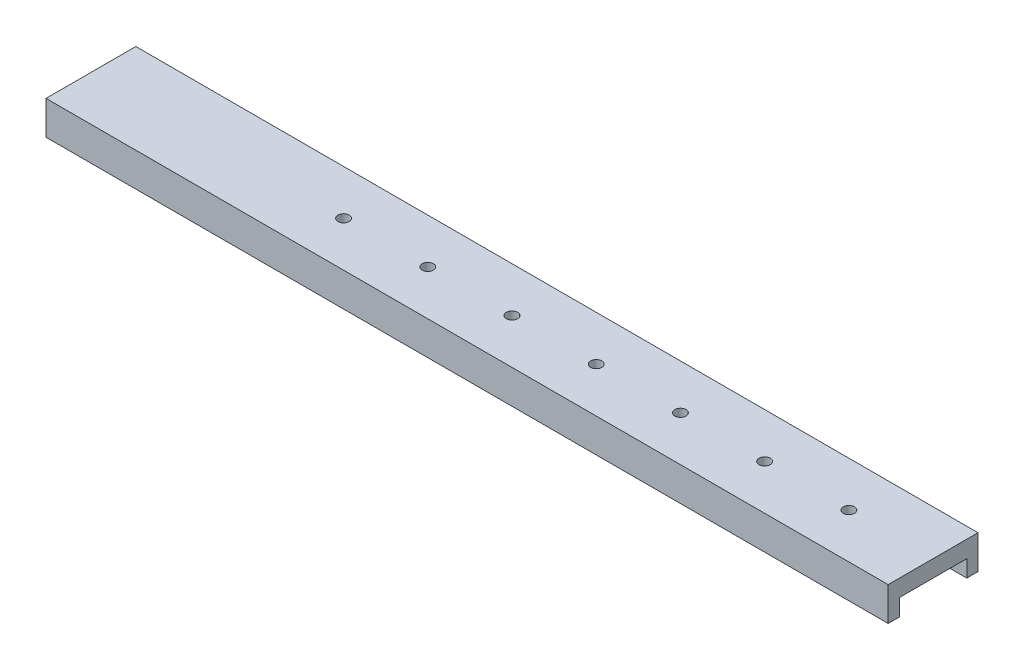
ISO-10303-21;
HEADER;
FILE_DESCRIPTION(('STEP AP214'),'2;1');
FILE_NAME('part.step','',(''),(''),'','','');
FILE_SCHEMA(('AUTOMOTIVE_DESIGN { 1 0 10303 214 1 1 1 1 }'));
ENDSEC;
DATA;
#1=APPLICATION_CONTEXT('core data for automotive mechanical design processes');
#2=APPLICATION_PROTOCOL_DEFINITION('international standard','automotive_design',2000,#1);
#3=PRODUCT_CONTEXT('',#1,'mechanical');
#4=PRODUCT('Part','Part','',(#3));
#5=PRODUCT_RELATED_PRODUCT_CATEGORY('part','',(#4));
#6=PRODUCT_DEFINITION_FORMATION('','',#4);
#7=PRODUCT_DEFINITION_CONTEXT('part definition',#1,'design');
#8=PRODUCT_DEFINITION('design','',#6,#7);
#9=PRODUCT_DEFINITION_SHAPE('','',#8);
#10=(LENGTH_UNIT() NAMED_UNIT(*) SI_UNIT(.MILLI.,.METRE.));
#11=(NAMED_UNIT(*) PLANE_ANGLE_UNIT() SI_UNIT($,.RADIAN.));
#12=(NAMED_UNIT(*) SI_UNIT($,.STERADIAN.) SOLID_ANGLE_UNIT());
#13=UNCERTAINTY_MEASURE_WITH_UNIT(LENGTH_MEASURE(1.E-05),#10,'distance_accuracy_value','');
#14=(GEOMETRIC_REPRESENTATION_CONTEXT(3) GLOBAL_UNCERTAINTY_ASSIGNED_CONTEXT((#13)) GLOBAL_UNIT_ASSIGNED_CONTEXT((#10,
#11,#12)) REPRESENTATION_CONTEXT('',''));
#15=CARTESIAN_POINT('',(0.,0.,0.));
#16=DIRECTION('',(0.,0.,1.));
#17=DIRECTION('',(1.,0.,0.));
#18=AXIS2_PLACEMENT_3D('',#15,#16,#17);
#19=CARTESIAN_POINT('',(375.,-30.,40.));
#20=DIRECTION('',(1.,0.,0.));
#21=DIRECTION('',(0.,0.,-1.));
#22=AXIS2_PLACEMENT_3D('',#19,#20,#21);
#23=PLANE('',#22);
#24=DIRECTION('',(0.,1.,0.));
#25=VECTOR('',#24,1.);
#26=CARTESIAN_POINT('',(375.,-30.,-30.));
#27=LINE('',#26,#25);
#28=CARTESIAN_POINT('',(375.,-30.,-30.));
#29=VERTEX_POINT('',#28);
#30=CARTESIAN_POINT('',(375.,-15.,-30.));
#31=VERTEX_POINT('',#30);
#32=EDGE_CURVE('E125',#29,#31,#27,.T.);
#33=ORIENTED_EDGE('',*,*,#32,.F.);
#34=DIRECTION('',(0.,0.,-1.));
#35=VECTOR('',#34,1.);
#36=CARTESIAN_POINT('',(375.,-30.,40.));
#37=LINE('',#36,#35);
#38=CARTESIAN_POINT('',(375.,-30.,-40.));
#39=VERTEX_POINT('',#38);
#40=EDGE_CURVE('E81',#29,#39,#37,.T.);
#41=ORIENTED_EDGE('',*,*,#40,.T.);
#42=DIRECTION('',(0.,1.,0.));
#43=VECTOR('',#42,1.);
#44=CARTESIAN_POINT('',(375.,-30.,-40.));
#45=LINE('',#44,#43);
#46=CARTESIAN_POINT('',(375.,0.,-40.));
#47=VERTEX_POINT('',#46);
#48=EDGE_CURVE('E190',#39,#47,#45,.T.);
#49=ORIENTED_EDGE('',*,*,#48,.T.);
#50=DIRECTION('',(0.,0.,-1.));
#51=VECTOR('',#50,1.);
#52=CARTESIAN_POINT('',(375.,0.,40.));
#53=LINE('',#52,#51);
#54=CARTESIAN_POINT('',(375.,0.,40.));
#55=VERTEX_POINT('',#54);
#56=EDGE_CURVE('E179',#55,#47,#53,.T.);
#57=ORIENTED_EDGE('',*,*,#56,.F.);
#58=DIRECTION('',(0.,1.,0.));
#59=VECTOR('',#58,1.);
#60=CARTESIAN_POINT('',(375.,-30.,40.));
#61=LINE('',#60,#59);
#62=CARTESIAN_POINT('',(375.,-30.,40.));
#63=VERTEX_POINT('',#62);
#64=EDGE_CURVE('E11',#63,#55,#61,.T.);
#65=ORIENTED_EDGE('',*,*,#64,.F.);
#66=CARTESIAN_POINT('',(375.,-30.,30.));
#67=VERTEX_POINT('',#66);
#68=EDGE_CURVE('E180',#63,#67,#37,.T.);
#69=ORIENTED_EDGE('',*,*,#68,.T.);
#70=DIRECTION('',(0.,-1.,0.));
#71=VECTOR('',#70,1.);
#72=CARTESIAN_POINT('',(375.,-15.,30.));
#73=LINE('',#72,#71);
#74=CARTESIAN_POINT('',(375.,-15.,30.));
#75=VERTEX_POINT('',#74);
#76=EDGE_CURVE('E128',#75,#67,#73,.T.);
#77=ORIENTED_EDGE('',*,*,#76,.F.);
#78=DIRECTION('',(0.,0.,1.));
#79=VECTOR('',#78,1.);
#80=CARTESIAN_POINT('',(375.,-15.,-30.));
#81=LINE('',#80,#79);
#82=EDGE_CURVE('E112',#31,#75,#81,.T.);
#83=ORIENTED_EDGE('',*,*,#82,.F.);
#84=EDGE_LOOP('',(#33,#41,#49,#57,#65,#69,#77,#83));
#85=FACE_BOUND('',#84,.T.);
#86=ADVANCED_FACE('F33',(#85),#23,.T.);
#87=CARTESIAN_POINT('',(-375.,-30.,40.));
#88=DIRECTION('',(0.,0.,1.));
#89=DIRECTION('',(1.,0.,0.));
#90=AXIS2_PLACEMENT_3D('',#87,#88,#89);
#91=PLANE('',#90);
#92=DIRECTION('',(1.,0.,0.));
#93=VECTOR('',#92,1.);
#94=CARTESIAN_POINT('',(-375.,0.,40.));
#95=LINE('',#94,#93);
#96=CARTESIAN_POINT('',(-375.,0.,40.));
#97=VERTEX_POINT('',#96);
#98=EDGE_CURVE('E199',#97,#55,#95,.T.);
#99=ORIENTED_EDGE('',*,*,#98,.F.);
#100=DIRECTION('',(0.,1.,0.));
#101=VECTOR('',#100,1.);
#102=CARTESIAN_POINT('',(-375.,-30.,40.));
#103=LINE('',#102,#101);
#104=CARTESIAN_POINT('',(-375.,-30.,40.));
#105=VERTEX_POINT('',#104);
#106=EDGE_CURVE('E41',#105,#97,#103,.T.);
#107=ORIENTED_EDGE('',*,*,#106,.F.);
#108=DIRECTION('',(1.,0.,0.));
#109=VECTOR('',#108,1.);
#110=CARTESIAN_POINT('',(-375.,-30.,40.));
#111=LINE('',#110,#109);
#112=EDGE_CURVE('E188',#105,#63,#111,.T.);
#113=ORIENTED_EDGE('',*,*,#112,.T.);
#114=ORIENTED_EDGE('',*,*,#64,.T.);
#115=EDGE_LOOP('',(#99,#107,#113,#114));
#116=FACE_BOUND('',#115,.T.);
#117=ADVANCED_FACE('F211',(#116),#91,.T.);
#118=CARTESIAN_POINT('',(-375.,-30.,40.));
#119=DIRECTION('',(-1.,0.,0.));
#120=DIRECTION('',(0.,0.,1.));
#121=AXIS2_PLACEMENT_3D('',#118,#119,#120);
#122=PLANE('',#121);
#123=DIRECTION('',(0.,0.,1.));
#124=VECTOR('',#123,1.);
#125=CARTESIAN_POINT('',(-375.,0.,40.));
#126=LINE('',#125,#124);
#127=CARTESIAN_POINT('',(-375.,0.,-40.));
#128=VERTEX_POINT('',#127);
#129=EDGE_CURVE('E196',#128,#97,#126,.T.);
#130=ORIENTED_EDGE('',*,*,#129,.F.);
#131=DIRECTION('',(0.,1.,0.));
#132=VECTOR('',#131,1.);
#133=CARTESIAN_POINT('',(-375.,-30.,-40.));
#134=LINE('',#133,#132);
#135=CARTESIAN_POINT('',(-375.,-30.,-40.));
#136=VERTEX_POINT('',#135);
#137=EDGE_CURVE('E203',#136,#128,#134,.T.);
#138=ORIENTED_EDGE('',*,*,#137,.F.);
#139=DIRECTION('',(0.,0.,1.));
#140=VECTOR('',#139,1.);
#141=CARTESIAN_POINT('',(-375.,-30.,40.));
#142=LINE('',#141,#140);
#143=EDGE_CURVE('E185',#136,#105,#142,.T.);
#144=ORIENTED_EDGE('',*,*,#143,.T.);
#145=ORIENTED_EDGE('',*,*,#106,.T.);
#146=EDGE_LOOP('',(#130,#138,#144,#145));
#147=FACE_BOUND('',#146,.T.);
#148=ADVANCED_FACE('F215',(#147),#122,.T.);
#149=CARTESIAN_POINT('',(-375.,-30.,-40.));
#150=DIRECTION('',(0.,0.,-1.));
#151=DIRECTION('',(-1.,0.,0.));
#152=AXIS2_PLACEMENT_3D('',#149,#150,#151);
#153=PLANE('',#152);
#154=DIRECTION('',(-1.,0.,0.));
#155=VECTOR('',#154,1.);
#156=CARTESIAN_POINT('',(-375.,0.,-40.));
#157=LINE('',#156,#155);
#158=EDGE_CURVE('E193',#47,#128,#157,.T.);
#159=ORIENTED_EDGE('',*,*,#158,.F.);
#160=ORIENTED_EDGE('',*,*,#48,.F.);
#161=DIRECTION('',(-1.,0.,0.));
#162=VECTOR('',#161,1.);
#163=CARTESIAN_POINT('',(-375.,-30.,-40.));
#164=LINE('',#163,#162);
#165=EDGE_CURVE('E182',#39,#136,#164,.T.);
#166=ORIENTED_EDGE('',*,*,#165,.T.);
#167=ORIENTED_EDGE('',*,*,#137,.T.);
#168=EDGE_LOOP('',(#159,#160,#166,#167));
#169=FACE_BOUND('',#168,.T.);
#170=ADVANCED_FACE('F207',(#169),#153,.T.);
#171=CARTESIAN_POINT('',(0.,-30.,0.));
#172=DIRECTION('',(0.,-1.,0.));
#173=DIRECTION('',(0.,0.,-1.));
#174=AXIS2_PLACEMENT_3D('',#171,#172,#173);
#175=PLANE('',#174);
#176=DIRECTION('',(1.,0.,0.));
#177=VECTOR('',#176,1.);
#178=CARTESIAN_POINT('',(-225.,-30.,-30.));
#179=LINE('',#178,#177);
#180=CARTESIAN_POINT('',(-225.,-30.,-30.));
#181=VERTEX_POINT('',#180);
#182=EDGE_CURVE('E137',#181,#29,#179,.T.);
#183=ORIENTED_EDGE('',*,*,#182,.F.);
#184=DIRECTION('',(0.,0.,-1.));
#185=VECTOR('',#184,1.);
#186=CARTESIAN_POINT('',(-225.,-30.,30.));
#187=LINE('',#186,#185);
#188=CARTESIAN_POINT('',(-225.,-30.,30.));
#189=VERTEX_POINT('',#188);
#190=EDGE_CURVE('E121',#189,#181,#187,.T.);
#191=ORIENTED_EDGE('',*,*,#190,.F.);
#192=DIRECTION('',(1.,0.,0.));
#193=VECTOR('',#192,1.);
#194=CARTESIAN_POINT('',(-225.,-30.,30.));
#195=LINE('',#194,#193);
#196=EDGE_CURVE('E115',#189,#67,#195,.T.);
#197=ORIENTED_EDGE('',*,*,#196,.T.);
#198=ORIENTED_EDGE('',*,*,#68,.F.);
#199=ORIENTED_EDGE('',*,*,#112,.F.);
#200=ORIENTED_EDGE('',*,*,#143,.F.);
#201=ORIENTED_EDGE('',*,*,#165,.F.);
#202=ORIENTED_EDGE('',*,*,#40,.F.);
#203=EDGE_LOOP('',(#183,#191,#197,#198,#199,#200,#201,#202));
#204=FACE_BOUND('',#203,.T.);
#205=ADVANCED_FACE('F218',(#204),#175,.T.);
#206=CARTESIAN_POINT('',(0.,0.,0.));
#207=DIRECTION('',(0.,-1.,0.));
#208=DIRECTION('',(0.,0.,-1.));
#209=AXIS2_PLACEMENT_3D('',#206,#207,#208);
#210=PLANE('',#209);
#211=CARTESIAN_POINT('',(-150.,0.,3.14233320495882E-12));
#212=DIRECTION('',(0.,1.,0.));
#213=DIRECTION('',(0.,0.,1.));
#214=AXIS2_PLACEMENT_3D('',#211,#212,#213);
#215=CIRCLE('',#214,4.99999999999999);
#216=CARTESIAN_POINT('',(-150.,0.,5.00000000000313));
#217=VERTEX_POINT('',#216);
#218=EDGE_CURVE('E158',#217,#217,#215,.T.);
#219=ORIENTED_EDGE('',*,*,#218,.F.);
#220=EDGE_LOOP('',(#219));
#221=FACE_BOUND('',#220,.T.);
#222=CARTESIAN_POINT('',(-74.9999999999997,0.,2.61861100413235E-12));
#223=DIRECTION('',(0.,1.,0.));
#224=DIRECTION('',(0.,0.,1.));
#225=AXIS2_PLACEMENT_3D('',#222,#223,#224);
#226=CIRCLE('',#225,4.99999999999999);
#227=CARTESIAN_POINT('',(-74.9999999999997,0.,5.00000000000261));
#228=VERTEX_POINT('',#227);
#229=EDGE_CURVE('E161',#228,#228,#226,.T.);
#230=ORIENTED_EDGE('',*,*,#229,.F.);
#231=EDGE_LOOP('',(#230));
#232=FACE_BOUND('',#231,.T.);
#233=CARTESIAN_POINT('',(2.77555756156289E-13,0.,2.09488880330588E-12));
#234=DIRECTION('',(0.,1.,0.));
#235=DIRECTION('',(0.,0.,1.));
#236=AXIS2_PLACEMENT_3D('',#233,#234,#235);
#237=CIRCLE('',#236,4.99999999999999);
#238=CARTESIAN_POINT('',(2.77555756156289E-13,0.,5.00000000000208));
#239=VERTEX_POINT('',#238);
#240=EDGE_CURVE('E164',#239,#239,#237,.T.);
#241=ORIENTED_EDGE('',*,*,#240,.F.);
#242=EDGE_LOOP('',(#241));
#243=FACE_BOUND('',#242,.T.);
#244=CARTESIAN_POINT('',(75.0000000000002,0.,1.57116660247941E-12));
#245=DIRECTION('',(0.,1.,0.));
#246=DIRECTION('',(0.,0.,1.));
#247=AXIS2_PLACEMENT_3D('',#244,#245,#246);
#248=CIRCLE('',#247,4.99999999999999);
#249=CARTESIAN_POINT('',(75.0000000000002,0.,5.00000000000156));
#250=VERTEX_POINT('',#249);
#251=EDGE_CURVE('E167',#250,#250,#248,.T.);
#252=ORIENTED_EDGE('',*,*,#251,.F.);
#253=EDGE_LOOP('',(#252));
#254=FACE_BOUND('',#253,.T.);
#255=CARTESIAN_POINT('',(150.,0.,1.04744440165294E-12));
#256=DIRECTION('',(0.,1.,0.));
#257=DIRECTION('',(0.,0.,1.));
#258=AXIS2_PLACEMENT_3D('',#255,#256,#257);
#259=CIRCLE('',#258,5.00000000000005);
#260=CARTESIAN_POINT('',(150.,0.,5.0000000000011));
#261=VERTEX_POINT('',#260);
#262=EDGE_CURVE('E170',#261,#261,#259,.T.);
#263=ORIENTED_EDGE('',*,*,#262,.F.);
#264=EDGE_LOOP('',(#263));
#265=FACE_BOUND('',#264,.T.);
#266=CARTESIAN_POINT('',(225.,0.,5.2372220082647E-13));
#267=DIRECTION('',(0.,1.,0.));
#268=DIRECTION('',(0.,0.,1.));
#269=AXIS2_PLACEMENT_3D('',#266,#267,#268);
#270=CIRCLE('',#269,4.99999999999999);
#271=CARTESIAN_POINT('',(225.,0.,5.00000000000051));
#272=VERTEX_POINT('',#271);
#273=EDGE_CURVE('E173',#272,#272,#270,.T.);
#274=ORIENTED_EDGE('',*,*,#273,.F.);
#275=EDGE_LOOP('',(#274));
#276=FACE_BOUND('',#275,.T.);
#277=CARTESIAN_POINT('',(300.,0.,0.));
#278=DIRECTION('',(0.,1.,0.));
#279=DIRECTION('',(0.,0.,1.));
#280=AXIS2_PLACEMENT_3D('',#277,#278,#279);
#281=CIRCLE('',#280,4.99999999999999);
#282=CARTESIAN_POINT('',(300.,0.,4.99999999999999));
#283=VERTEX_POINT('',#282);
#284=EDGE_CURVE('E176',#283,#283,#281,.T.);
#285=ORIENTED_EDGE('',*,*,#284,.F.);
#286=EDGE_LOOP('',(#285));
#287=FACE_BOUND('',#286,.T.);
#288=ORIENTED_EDGE('',*,*,#56,.T.);
#289=ORIENTED_EDGE('',*,*,#158,.T.);
#290=ORIENTED_EDGE('',*,*,#129,.T.);
#291=ORIENTED_EDGE('',*,*,#98,.T.);
#292=EDGE_LOOP('',(#288,#289,#290,#291));
#293=FACE_BOUND('',#292,.T.);
#294=ADVANCED_FACE('F210',(#221,#232,#243,#254,#265,#276,#287,#293),#210,.F.);
#295=CARTESIAN_POINT('',(300.,-30.,0.));
#296=DIRECTION('',(0.,1.,0.));
#297=DIRECTION('',(0.,0.,1.));
#298=AXIS2_PLACEMENT_3D('',#295,#296,#297);
#299=CYLINDRICAL_SURFACE('',#298,4.99999999999999);
#300=CARTESIAN_POINT('',(300.,-15.,0.));
#301=DIRECTION('',(0.,1.,0.));
#302=DIRECTION('',(0.,0.,1.));
#303=AXIS2_PLACEMENT_3D('',#300,#301,#302);
#304=CIRCLE('',#303,4.99999999999999);
#305=CARTESIAN_POINT('',(300.,-15.,4.99999999999999));
#306=VERTEX_POINT('',#305);
#307=EDGE_CURVE('E155',#306,#306,#304,.F.);
#308=ORIENTED_EDGE('',*,*,#307,.T.);
#309=EDGE_LOOP('',(#308));
#310=FACE_BOUND('',#309,.T.);
#311=ORIENTED_EDGE('',*,*,#284,.T.);
#312=EDGE_LOOP('',(#311));
#313=FACE_BOUND('',#312,.T.);
#314=ADVANCED_FACE('F250',(#310,#313),#299,.F.);
#315=CARTESIAN_POINT('',(225.,-30.,5.2372220082647E-13));
#316=DIRECTION('',(0.,1.,0.));
#317=DIRECTION('',(0.,0.,1.));
#318=AXIS2_PLACEMENT_3D('',#315,#316,#317);
#319=CYLINDRICAL_SURFACE('',#318,4.99999999999999);
#320=CARTESIAN_POINT('',(225.,-15.,5.2372220082647E-13));
#321=DIRECTION('',(0.,1.,0.));
#322=DIRECTION('',(0.,0.,1.));
#323=AXIS2_PLACEMENT_3D('',#320,#321,#322);
#324=CIRCLE('',#323,4.99999999999999);
#325=CARTESIAN_POINT('',(225.,-15.,5.00000000000051));
#326=VERTEX_POINT('',#325);
#327=EDGE_CURVE('E152',#326,#326,#324,.F.);
#328=ORIENTED_EDGE('',*,*,#327,.T.);
#329=EDGE_LOOP('',(#328));
#330=FACE_BOUND('',#329,.T.);
#331=ORIENTED_EDGE('',*,*,#273,.T.);
#332=EDGE_LOOP('',(#331));
#333=FACE_BOUND('',#332,.T.);
#334=ADVANCED_FACE('F255',(#330,#333),#319,.F.);
#335=CARTESIAN_POINT('',(150.,-30.,1.04744440165294E-12));
#336=DIRECTION('',(0.,1.,0.));
#337=DIRECTION('',(0.,0.,1.));
#338=AXIS2_PLACEMENT_3D('',#335,#336,#337);
#339=CYLINDRICAL_SURFACE('',#338,5.00000000000005);
#340=CARTESIAN_POINT('',(150.,-15.,1.04744440165294E-12));
#341=DIRECTION('',(0.,1.,0.));
#342=DIRECTION('',(0.,0.,1.));
#343=AXIS2_PLACEMENT_3D('',#340,#341,#342);
#344=CIRCLE('',#343,5.00000000000005);
#345=CARTESIAN_POINT('',(150.,-15.,5.0000000000011));
#346=VERTEX_POINT('',#345);
#347=EDGE_CURVE('E149',#346,#346,#344,.F.);
#348=ORIENTED_EDGE('',*,*,#347,.T.);
#349=EDGE_LOOP('',(#348));
#350=FACE_BOUND('',#349,.T.);
#351=ORIENTED_EDGE('',*,*,#262,.T.);
#352=EDGE_LOOP('',(#351));
#353=FACE_BOUND('',#352,.T.);
#354=ADVANCED_FACE('F259',(#350,#353),#339,.F.);
#355=CARTESIAN_POINT('',(75.0000000000002,-30.,1.57116660247941E-12));
#356=DIRECTION('',(0.,1.,0.));
#357=DIRECTION('',(0.,0.,1.));
#358=AXIS2_PLACEMENT_3D('',#355,#356,#357);
#359=CYLINDRICAL_SURFACE('',#358,4.99999999999999);
#360=CARTESIAN_POINT('',(75.0000000000002,-15.,1.57116660247941E-12));
#361=DIRECTION('',(0.,1.,0.));
#362=DIRECTION('',(0.,0.,1.));
#363=AXIS2_PLACEMENT_3D('',#360,#361,#362);
#364=CIRCLE('',#363,4.99999999999999);
#365=CARTESIAN_POINT('',(75.0000000000002,-15.,5.00000000000156));
#366=VERTEX_POINT('',#365);
#367=EDGE_CURVE('E146',#366,#366,#364,.F.);
#368=ORIENTED_EDGE('',*,*,#367,.T.);
#369=EDGE_LOOP('',(#368));
#370=FACE_BOUND('',#369,.T.);
#371=ORIENTED_EDGE('',*,*,#251,.T.);
#372=EDGE_LOOP('',(#371));
#373=FACE_BOUND('',#372,.T.);
#374=ADVANCED_FACE('F263',(#370,#373),#359,.F.);
#375=CARTESIAN_POINT('',(2.77555756156289E-13,-30.,2.09488880330588E-12));
#376=DIRECTION('',(0.,1.,0.));
#377=DIRECTION('',(0.,0.,1.));
#378=AXIS2_PLACEMENT_3D('',#375,#376,#377);
#379=CYLINDRICAL_SURFACE('',#378,4.99999999999999);
#380=CARTESIAN_POINT('',(2.77555756156289E-13,-15.,2.09488880330588E-12));
#381=DIRECTION('',(0.,1.,0.));
#382=DIRECTION('',(0.,0.,1.));
#383=AXIS2_PLACEMENT_3D('',#380,#381,#382);
#384=CIRCLE('',#383,4.99999999999999);
#385=CARTESIAN_POINT('',(2.77555756156289E-13,-15.,5.00000000000208));
#386=VERTEX_POINT('',#385);
#387=EDGE_CURVE('E143',#386,#386,#384,.F.);
#388=ORIENTED_EDGE('',*,*,#387,.T.);
#389=EDGE_LOOP('',(#388));
#390=FACE_BOUND('',#389,.T.);
#391=ORIENTED_EDGE('',*,*,#240,.T.);
#392=EDGE_LOOP('',(#391));
#393=FACE_BOUND('',#392,.T.);
#394=ADVANCED_FACE('F267',(#390,#393),#379,.F.);
#395=CARTESIAN_POINT('',(-74.9999999999997,-30.,2.61861100413235E-12));
#396=DIRECTION('',(0.,1.,0.));
#397=DIRECTION('',(0.,0.,1.));
#398=AXIS2_PLACEMENT_3D('',#395,#396,#397);
#399=CYLINDRICAL_SURFACE('',#398,4.99999999999999);
#400=CARTESIAN_POINT('',(-74.9999999999997,-15.,2.61861100413235E-12));
#401=DIRECTION('',(0.,1.,0.));
#402=DIRECTION('',(0.,0.,1.));
#403=AXIS2_PLACEMENT_3D('',#400,#401,#402);
#404=CIRCLE('',#403,4.99999999999999);
#405=CARTESIAN_POINT('',(-74.9999999999997,-15.,5.00000000000261));
#406=VERTEX_POINT('',#405);
#407=EDGE_CURVE('E140',#406,#406,#404,.F.);
#408=ORIENTED_EDGE('',*,*,#407,.T.);
#409=EDGE_LOOP('',(#408));
#410=FACE_BOUND('',#409,.T.);
#411=ORIENTED_EDGE('',*,*,#229,.T.);
#412=EDGE_LOOP('',(#411));
#413=FACE_BOUND('',#412,.T.);
#414=ADVANCED_FACE('F271',(#410,#413),#399,.F.);
#415=CARTESIAN_POINT('',(-150.,-30.,3.14233320495882E-12));
#416=DIRECTION('',(0.,1.,0.));
#417=DIRECTION('',(0.,0.,1.));
#418=AXIS2_PLACEMENT_3D('',#415,#416,#417);
#419=CYLINDRICAL_SURFACE('',#418,4.99999999999999);
#420=CARTESIAN_POINT('',(-150.,-15.,3.14233320495882E-12));
#421=DIRECTION('',(0.,1.,0.));
#422=DIRECTION('',(0.,0.,1.));
#423=AXIS2_PLACEMENT_3D('',#420,#421,#422);
#424=CIRCLE('',#423,4.99999999999999);
#425=CARTESIAN_POINT('',(-150.,-15.,5.00000000000313));
#426=VERTEX_POINT('',#425);
#427=EDGE_CURVE('E36',#426,#426,#424,.F.);
#428=ORIENTED_EDGE('',*,*,#427,.T.);
#429=EDGE_LOOP('',(#428));
#430=FACE_BOUND('',#429,.T.);
#431=ORIENTED_EDGE('',*,*,#218,.T.);
#432=EDGE_LOOP('',(#431));
#433=FACE_BOUND('',#432,.T.);
#434=ADVANCED_FACE('F228',(#430,#433),#419,.F.);
#435=CARTESIAN_POINT('',(-225.,-15.,-30.));
#436=DIRECTION('',(0.,1.,0.));
#437=DIRECTION('',(0.,0.,1.));
#438=AXIS2_PLACEMENT_3D('',#435,#436,#437);
#439=PLANE('',#438);
#440=ORIENTED_EDGE('',*,*,#327,.F.);
#441=EDGE_LOOP('',(#440));
#442=FACE_BOUND('',#441,.T.);
#443=ORIENTED_EDGE('',*,*,#367,.F.);
#444=EDGE_LOOP('',(#443));
#445=FACE_BOUND('',#444,.T.);
#446=ORIENTED_EDGE('',*,*,#407,.F.);
#447=EDGE_LOOP('',(#446));
#448=FACE_BOUND('',#447,.T.);
#449=ORIENTED_EDGE('',*,*,#82,.T.);
#450=DIRECTION('',(1.,0.,0.));
#451=VECTOR('',#450,1.);
#452=CARTESIAN_POINT('',(-225.,-15.,30.));
#453=LINE('',#452,#451);
#454=CARTESIAN_POINT('',(-225.,-15.,30.));
#455=VERTEX_POINT('',#454);
#456=EDGE_CURVE('E106',#455,#75,#453,.T.);
#457=ORIENTED_EDGE('',*,*,#456,.F.);
#458=DIRECTION('',(0.,0.,1.));
#459=VECTOR('',#458,1.);
#460=CARTESIAN_POINT('',(-225.,-15.,-30.));
#461=LINE('',#460,#459);
#462=CARTESIAN_POINT('',(-225.,-15.,-30.));
#463=VERTEX_POINT('',#462);
#464=EDGE_CURVE('E109',#463,#455,#461,.T.);
#465=ORIENTED_EDGE('',*,*,#464,.F.);
#466=DIRECTION('',(1.,0.,0.));
#467=VECTOR('',#466,1.);
#468=CARTESIAN_POINT('',(-225.,-15.,-30.));
#469=LINE('',#468,#467);
#470=EDGE_CURVE('E135',#463,#31,#469,.T.);
#471=ORIENTED_EDGE('',*,*,#470,.T.);
#472=EDGE_LOOP('',(#449,#457,#465,#471));
#473=FACE_BOUND('',#472,.T.);
#474=ORIENTED_EDGE('',*,*,#427,.F.);
#475=EDGE_LOOP('',(#474));
#476=FACE_BOUND('',#475,.T.);
#477=ORIENTED_EDGE('',*,*,#387,.F.);
#478=EDGE_LOOP('',(#477));
#479=FACE_BOUND('',#478,.T.);
#480=ORIENTED_EDGE('',*,*,#347,.F.);
#481=EDGE_LOOP('',(#480));
#482=FACE_BOUND('',#481,.T.);
#483=ORIENTED_EDGE('',*,*,#307,.F.);
#484=EDGE_LOOP('',(#483));
#485=FACE_BOUND('',#484,.T.);
#486=ADVANCED_FACE('F107',(#442,#445,#448,#473,#476,#479,#482,#485),#439,.F.);
#487=CARTESIAN_POINT('',(-225.,-30.,-30.));
#488=DIRECTION('',(0.,0.,-1.));
#489=DIRECTION('',(-1.,0.,0.));
#490=AXIS2_PLACEMENT_3D('',#487,#488,#489);
#491=PLANE('',#490);
#492=ORIENTED_EDGE('',*,*,#32,.T.);
#493=ORIENTED_EDGE('',*,*,#470,.F.);
#494=DIRECTION('',(0.,1.,0.));
#495=VECTOR('',#494,1.);
#496=CARTESIAN_POINT('',(-225.,-30.,-30.));
#497=LINE('',#496,#495);
#498=EDGE_CURVE('E116',#181,#463,#497,.T.);
#499=ORIENTED_EDGE('',*,*,#498,.F.);
#500=ORIENTED_EDGE('',*,*,#182,.T.);
#501=EDGE_LOOP('',(#492,#493,#499,#500));
#502=FACE_BOUND('',#501,.T.);
#503=ADVANCED_FACE('F220',(#502),#491,.F.);
#504=CARTESIAN_POINT('',(-225.,-15.,30.));
#505=DIRECTION('',(0.,0.,1.));
#506=DIRECTION('',(0.,-1.,0.));
#507=AXIS2_PLACEMENT_3D('',#504,#505,#506);
#508=PLANE('',#507);
#509=ORIENTED_EDGE('',*,*,#76,.T.);
#510=ORIENTED_EDGE('',*,*,#196,.F.);
#511=DIRECTION('',(0.,-1.,0.));
#512=VECTOR('',#511,1.);
#513=CARTESIAN_POINT('',(-225.,-15.,30.));
#514=LINE('',#513,#512);
#515=EDGE_CURVE('E49',#455,#189,#514,.T.);
#516=ORIENTED_EDGE('',*,*,#515,.F.);
#517=ORIENTED_EDGE('',*,*,#456,.T.);
#518=EDGE_LOOP('',(#509,#510,#516,#517));
#519=FACE_BOUND('',#518,.T.);
#520=ADVANCED_FACE('F118',(#519),#508,.F.);
#521=CARTESIAN_POINT('',(-225.,0.,0.));
#522=DIRECTION('',(1.,0.,0.));
#523=DIRECTION('',(0.,0.,-1.));
#524=AXIS2_PLACEMENT_3D('',#521,#522,#523);
#525=PLANE('',#524);
#526=ORIENTED_EDGE('',*,*,#464,.T.);
#527=ORIENTED_EDGE('',*,*,#515,.T.);
#528=ORIENTED_EDGE('',*,*,#190,.T.);
#529=ORIENTED_EDGE('',*,*,#498,.T.);
#530=EDGE_LOOP('',(#526,#527,#528,#529));
#531=FACE_BOUND('',#530,.T.);
#532=ADVANCED_FACE('F123',(#531),#525,.T.);
#533=CLOSED_SHELL('',(#86,#117,#148,#170,#205,#294,#314,#334,#354,#374,#394,#414,#434,#486,#503,
#520,#532));
#534=MANIFOLD_SOLID_BREP('B2',#533);
#535=ADVANCED_BREP_SHAPE_REPRESENTATION('',(#18,#534),#14);
#536=SHAPE_DEFINITION_REPRESENTATION(#9,#535);
ENDSEC;
END-ISO-10303-21;
